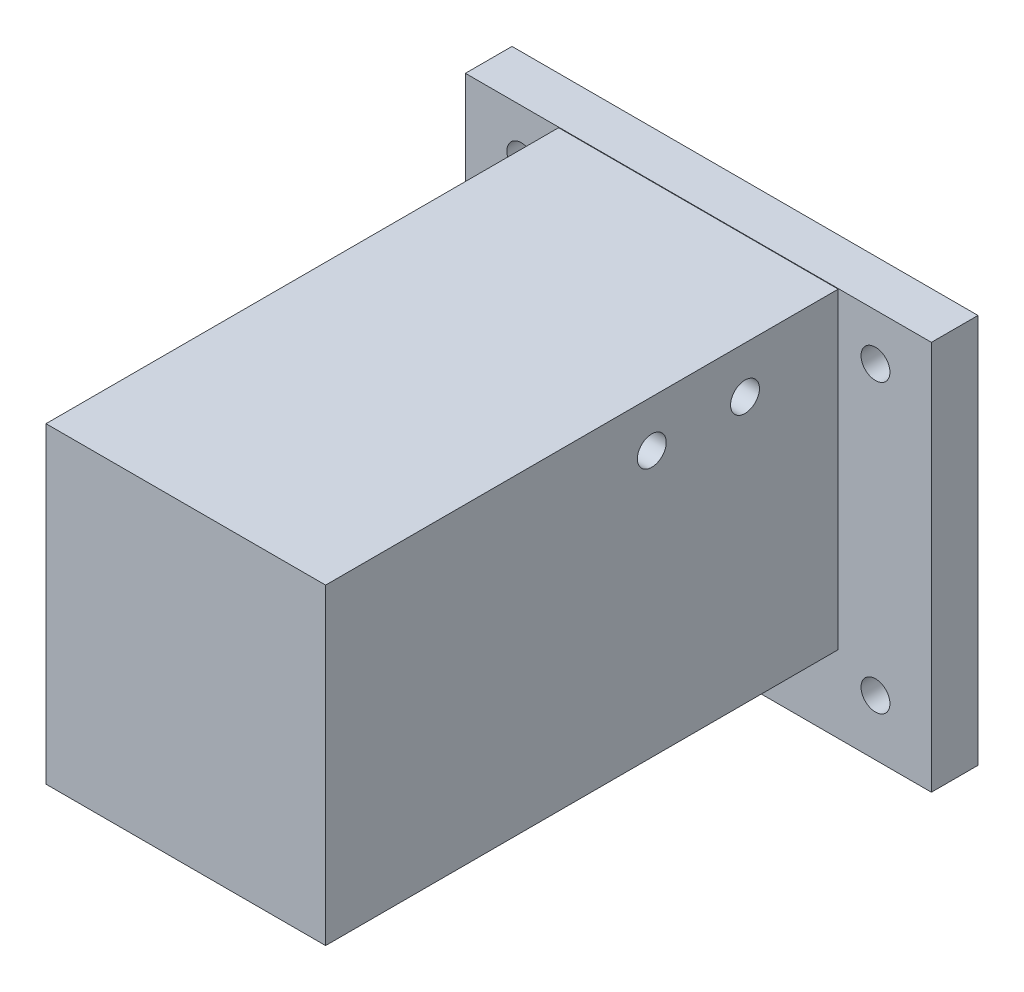
ISO-10303-21;
HEADER;
FILE_DESCRIPTION(('STEP AP214'),'2;1');
FILE_NAME('part.step','',(''),(''),'','','');
FILE_SCHEMA(('AUTOMOTIVE_DESIGN { 1 0 10303 214 1 1 1 1 }'));
ENDSEC;
DATA;
#1=APPLICATION_CONTEXT('core data for automotive mechanical design processes');
#2=APPLICATION_PROTOCOL_DEFINITION('international standard','automotive_design',2000,#1);
#3=PRODUCT_CONTEXT('',#1,'mechanical');
#4=PRODUCT('Part','Part','',(#3));
#5=PRODUCT_RELATED_PRODUCT_CATEGORY('part','',(#4));
#6=PRODUCT_DEFINITION_FORMATION('','',#4);
#7=PRODUCT_DEFINITION_CONTEXT('part definition',#1,'design');
#8=PRODUCT_DEFINITION('design','',#6,#7);
#9=PRODUCT_DEFINITION_SHAPE('','',#8);
#10=(LENGTH_UNIT() NAMED_UNIT(*) SI_UNIT(.MILLI.,.METRE.));
#11=(NAMED_UNIT(*) PLANE_ANGLE_UNIT() SI_UNIT($,.RADIAN.));
#12=(NAMED_UNIT(*) SI_UNIT($,.STERADIAN.) SOLID_ANGLE_UNIT());
#13=UNCERTAINTY_MEASURE_WITH_UNIT(LENGTH_MEASURE(1.E-05),#10,'distance_accuracy_value','');
#14=(GEOMETRIC_REPRESENTATION_CONTEXT(3) GLOBAL_UNCERTAINTY_ASSIGNED_CONTEXT((#13)) GLOBAL_UNIT_ASSIGNED_CONTEXT((#10,
#11,#12)) REPRESENTATION_CONTEXT('',''));
#15=CARTESIAN_POINT('',(0.,0.,0.));
#16=DIRECTION('',(0.,0.,1.));
#17=DIRECTION('',(1.,0.,0.));
#18=AXIS2_PLACEMENT_3D('',#15,#16,#17);
#19=CARTESIAN_POINT('',(0.,0.,5.));
#20=DIRECTION('',(0.,0.,1.));
#21=DIRECTION('',(1.,0.,0.));
#22=AXIS2_PLACEMENT_3D('',#19,#20,#21);
#23=PLANE('',#22);
#24=CARTESIAN_POINT('',(19.,-19.,5.));
#25=DIRECTION('',(0.,0.,1.));
#26=DIRECTION('',(1.,0.,0.));
#27=AXIS2_PLACEMENT_3D('',#24,#25,#26);
#28=CIRCLE('',#27,1.55);
#29=CARTESIAN_POINT('',(20.55,-19.,5.));
#30=VERTEX_POINT('',#29);
#31=EDGE_CURVE('E197',#30,#30,#28,.T.);
#32=ORIENTED_EDGE('',*,*,#31,.F.);
#33=EDGE_LOOP('',(#32));
#34=FACE_BOUND('',#33,.T.);
#35=DIRECTION('',(0.,1.,0.));
#36=VECTOR('',#35,1.);
#37=CARTESIAN_POINT('',(15.,16.75,5.));
#38=LINE('',#37,#36);
#39=CARTESIAN_POINT('',(15.,-16.75,5.));
#40=VERTEX_POINT('',#39);
#41=CARTESIAN_POINT('',(15.,16.75,5.));
#42=VERTEX_POINT('',#41);
#43=EDGE_CURVE('E272',#40,#42,#38,.T.);
#44=ORIENTED_EDGE('',*,*,#43,.F.);
#45=DIRECTION('',(1.,0.,0.));
#46=VECTOR('',#45,1.);
#47=CARTESIAN_POINT('',(-15.,-16.75,5.));
#48=LINE('',#47,#46);
#49=CARTESIAN_POINT('',(-15.,-16.75,5.));
#50=VERTEX_POINT('',#49);
#51=EDGE_CURVE('E292',#50,#40,#48,.T.);
#52=ORIENTED_EDGE('',*,*,#51,.F.);
#53=DIRECTION('',(0.,-1.,0.));
#54=VECTOR('',#53,1.);
#55=CARTESIAN_POINT('',(-15.,16.75,5.));
#56=LINE('',#55,#54);
#57=CARTESIAN_POINT('',(-15.,16.75,5.));
#58=VERTEX_POINT('',#57);
#59=EDGE_CURVE('E288',#58,#50,#56,.T.);
#60=ORIENTED_EDGE('',*,*,#59,.F.);
#61=DIRECTION('',(-1.,0.,0.));
#62=VECTOR('',#61,1.);
#63=CARTESIAN_POINT('',(-15.,16.75,5.));
#64=LINE('',#63,#62);
#65=EDGE_CURVE('E284',#42,#58,#64,.T.);
#66=ORIENTED_EDGE('',*,*,#65,.F.);
#67=EDGE_LOOP('',(#44,#52,#60,#66));
#68=FACE_BOUND('',#67,.T.);
#69=CARTESIAN_POINT('',(-19.,-19.,5.));
#70=DIRECTION('',(0.,0.,1.));
#71=DIRECTION('',(1.,0.,0.));
#72=AXIS2_PLACEMENT_3D('',#69,#70,#71);
#73=CIRCLE('',#72,1.55);
#74=CARTESIAN_POINT('',(-17.45,-19.,5.));
#75=VERTEX_POINT('',#74);
#76=EDGE_CURVE('E207',#75,#75,#73,.F.);
#77=ORIENTED_EDGE('',*,*,#76,.T.);
#78=EDGE_LOOP('',(#77));
#79=FACE_BOUND('',#78,.T.);
#80=DIRECTION('',(1.,0.,0.));
#81=VECTOR('',#80,1.);
#82=CARTESIAN_POINT('',(-25.,16.8068521324191,5.));
#83=LINE('',#82,#81);
#84=CARTESIAN_POINT('',(-25.,16.8068521324191,5.));
#85=VERTEX_POINT('',#84);
#86=CARTESIAN_POINT('',(25.,16.8068521324191,5.));
#87=VERTEX_POINT('',#86);
#88=EDGE_CURVE('E129',#85,#87,#83,.T.);
#89=ORIENTED_EDGE('',*,*,#88,.F.);
#90=DIRECTION('',(0.,-1.,0.));
#91=VECTOR('',#90,1.);
#92=CARTESIAN_POINT('',(-25.,25.,5.));
#93=LINE('',#92,#91);
#94=CARTESIAN_POINT('',(-25.,-25.,5.));
#95=VERTEX_POINT('',#94);
#96=EDGE_CURVE('E137',#85,#95,#93,.T.);
#97=ORIENTED_EDGE('',*,*,#96,.T.);
#98=DIRECTION('',(1.,0.,0.));
#99=VECTOR('',#98,1.);
#100=CARTESIAN_POINT('',(-25.,-25.,5.));
#101=LINE('',#100,#99);
#102=CARTESIAN_POINT('',(25.,-25.,5.));
#103=VERTEX_POINT('',#102);
#104=EDGE_CURVE('E150',#95,#103,#101,.T.);
#105=ORIENTED_EDGE('',*,*,#104,.T.);
#106=DIRECTION('',(0.,1.,0.));
#107=VECTOR('',#106,1.);
#108=CARTESIAN_POINT('',(25.,25.,5.));
#109=LINE('',#108,#107);
#110=EDGE_CURVE('E140',#103,#87,#109,.T.);
#111=ORIENTED_EDGE('',*,*,#110,.T.);
#112=EDGE_LOOP('',(#89,#97,#105,#111));
#113=FACE_BOUND('',#112,.T.);
#114=CARTESIAN_POINT('',(19.,11.8068521324191,5.));
#115=DIRECTION('',(0.,0.,1.));
#116=DIRECTION('',(1.,0.,0.));
#117=AXIS2_PLACEMENT_3D('',#114,#115,#116);
#118=CIRCLE('',#117,1.55);
#119=CARTESIAN_POINT('',(20.55,11.8068521324191,5.));
#120=VERTEX_POINT('',#119);
#121=EDGE_CURVE('E214',#120,#120,#118,.T.);
#122=ORIENTED_EDGE('',*,*,#121,.F.);
#123=EDGE_LOOP('',(#122));
#124=FACE_BOUND('',#123,.T.);
#125=CARTESIAN_POINT('',(-19.,11.8068521324191,5.));
#126=DIRECTION('',(0.,0.,1.));
#127=DIRECTION('',(1.,0.,0.));
#128=AXIS2_PLACEMENT_3D('',#125,#126,#127);
#129=CIRCLE('',#128,1.55);
#130=CARTESIAN_POINT('',(-17.45,11.8068521324191,5.));
#131=VERTEX_POINT('',#130);
#132=EDGE_CURVE('E143',#131,#131,#129,.F.);
#133=ORIENTED_EDGE('',*,*,#132,.T.);
#134=EDGE_LOOP('',(#133));
#135=FACE_BOUND('',#134,.T.);
#136=ADVANCED_FACE('F39',(#34,#68,#79,#113,#124,#135),#23,.T.);
#137=CARTESIAN_POINT('',(0.,0.,0.));
#138=DIRECTION('',(0.,0.,1.));
#139=DIRECTION('',(1.,0.,0.));
#140=AXIS2_PLACEMENT_3D('',#137,#138,#139);
#141=PLANE('',#140);
#142=CARTESIAN_POINT('',(19.,11.8068521324191,0.));
#143=DIRECTION('',(0.,0.,1.));
#144=DIRECTION('',(1.,0.,0.));
#145=AXIS2_PLACEMENT_3D('',#142,#143,#144);
#146=CIRCLE('',#145,1.55);
#147=CARTESIAN_POINT('',(20.55,11.8068521324191,0.));
#148=VERTEX_POINT('',#147);
#149=EDGE_CURVE('E211',#148,#148,#146,.T.);
#150=ORIENTED_EDGE('',*,*,#149,.T.);
#151=EDGE_LOOP('',(#150));
#152=FACE_BOUND('',#151,.T.);
#153=DIRECTION('',(0.,-1.,0.));
#154=VECTOR('',#153,1.);
#155=CARTESIAN_POINT('',(-25.,25.,0.));
#156=LINE('',#155,#154);
#157=CARTESIAN_POINT('',(-25.,16.8068521324191,0.));
#158=VERTEX_POINT('',#157);
#159=CARTESIAN_POINT('',(-25.,-25.,0.));
#160=VERTEX_POINT('',#159);
#161=EDGE_CURVE('E164',#158,#160,#156,.T.);
#162=ORIENTED_EDGE('',*,*,#161,.F.);
#163=DIRECTION('',(1.,0.,0.));
#164=VECTOR('',#163,1.);
#165=CARTESIAN_POINT('',(0.,16.8068521324191,0.));
#166=LINE('',#165,#164);
#167=CARTESIAN_POINT('',(25.,16.8068521324191,0.));
#168=VERTEX_POINT('',#167);
#169=EDGE_CURVE('E57',#158,#168,#166,.T.);
#170=ORIENTED_EDGE('',*,*,#169,.T.);
#171=DIRECTION('',(0.,1.,0.));
#172=VECTOR('',#171,1.);
#173=CARTESIAN_POINT('',(25.,25.,0.));
#174=LINE('',#173,#172);
#175=CARTESIAN_POINT('',(25.,-25.,0.));
#176=VERTEX_POINT('',#175);
#177=EDGE_CURVE('E160',#176,#168,#174,.T.);
#178=ORIENTED_EDGE('',*,*,#177,.F.);
#179=DIRECTION('',(1.,0.,0.));
#180=VECTOR('',#179,1.);
#181=CARTESIAN_POINT('',(-25.,-25.,0.));
#182=LINE('',#181,#180);
#183=EDGE_CURVE('E156',#160,#176,#182,.T.);
#184=ORIENTED_EDGE('',*,*,#183,.F.);
#185=EDGE_LOOP('',(#162,#170,#178,#184));
#186=FACE_BOUND('',#185,.T.);
#187=CARTESIAN_POINT('',(-19.,-19.,0.));
#188=DIRECTION('',(0.,0.,1.));
#189=DIRECTION('',(1.,0.,0.));
#190=AXIS2_PLACEMENT_3D('',#187,#188,#189);
#191=CIRCLE('',#190,1.55);
#192=CARTESIAN_POINT('',(-17.45,-19.,0.));
#193=VERTEX_POINT('',#192);
#194=EDGE_CURVE('E203',#193,#193,#191,.F.);
#195=ORIENTED_EDGE('',*,*,#194,.F.);
#196=EDGE_LOOP('',(#195));
#197=FACE_BOUND('',#196,.T.);
#198=CARTESIAN_POINT('',(19.,-19.,0.));
#199=DIRECTION('',(0.,0.,1.));
#200=DIRECTION('',(1.,0.,0.));
#201=AXIS2_PLACEMENT_3D('',#198,#199,#200);
#202=CIRCLE('',#201,1.55);
#203=CARTESIAN_POINT('',(20.55,-19.,0.));
#204=VERTEX_POINT('',#203);
#205=EDGE_CURVE('E208',#204,#204,#202,.T.);
#206=ORIENTED_EDGE('',*,*,#205,.T.);
#207=EDGE_LOOP('',(#206));
#208=FACE_BOUND('',#207,.T.);
#209=CARTESIAN_POINT('',(-19.,11.8068521324191,0.));
#210=DIRECTION('',(0.,0.,1.));
#211=DIRECTION('',(1.,0.,0.));
#212=AXIS2_PLACEMENT_3D('',#209,#210,#211);
#213=CIRCLE('',#212,1.55);
#214=CARTESIAN_POINT('',(-17.45,11.8068521324191,0.));
#215=VERTEX_POINT('',#214);
#216=EDGE_CURVE('E43',#215,#215,#213,.F.);
#217=ORIENTED_EDGE('',*,*,#216,.F.);
#218=EDGE_LOOP('',(#217));
#219=FACE_BOUND('',#218,.T.);
#220=ADVANCED_FACE('F342',(#152,#186,#197,#208,#219),#141,.F.);
#221=CARTESIAN_POINT('',(15.,16.75,75.));
#222=DIRECTION('',(-1.,0.,0.));
#223=DIRECTION('',(0.,0.,1.));
#224=AXIS2_PLACEMENT_3D('',#221,#222,#223);
#225=PLANE('',#224);
#226=DIRECTION('',(0.,1.,0.));
#227=VECTOR('',#226,1.);
#228=CARTESIAN_POINT('',(15.,-25.,60.));
#229=LINE('',#228,#227);
#230=CARTESIAN_POINT('',(15.,-16.75,60.));
#231=VERTEX_POINT('',#230);
#232=CARTESIAN_POINT('',(15.,16.75,60.));
#233=VERTEX_POINT('',#232);
#234=EDGE_CURVE('E244',#231,#233,#229,.T.);
#235=ORIENTED_EDGE('',*,*,#234,.F.);
#236=DIRECTION('',(0.,0.,-1.));
#237=VECTOR('',#236,1.);
#238=CARTESIAN_POINT('',(15.,-16.75,75.));
#239=LINE('',#238,#237);
#240=EDGE_CURVE('E296',#231,#40,#239,.T.);
#241=ORIENTED_EDGE('',*,*,#240,.T.);
#242=ORIENTED_EDGE('',*,*,#43,.T.);
#243=DIRECTION('',(0.,0.,-1.));
#244=VECTOR('',#243,1.);
#245=CARTESIAN_POINT('',(15.,16.75,75.));
#246=LINE('',#245,#244);
#247=EDGE_CURVE('E165',#233,#42,#246,.T.);
#248=ORIENTED_EDGE('',*,*,#247,.F.);
#249=EDGE_LOOP('',(#235,#241,#242,#248));
#250=FACE_BOUND('',#249,.T.);
#251=CARTESIAN_POINT('',(15.,11.75,15.));
#252=DIRECTION('',(-1.,0.,0.));
#253=DIRECTION('',(0.,0.,1.));
#254=AXIS2_PLACEMENT_3D('',#251,#252,#253);
#255=CIRCLE('',#254,1.55);
#256=CARTESIAN_POINT('',(15.,11.75,16.55));
#257=VERTEX_POINT('',#256);
#258=EDGE_CURVE('E196',#257,#257,#255,.F.);
#259=ORIENTED_EDGE('',*,*,#258,.F.);
#260=EDGE_LOOP('',(#259));
#261=FACE_BOUND('',#260,.T.);
#262=CARTESIAN_POINT('',(15.,11.75,25.));
#263=DIRECTION('',(-1.,0.,0.));
#264=DIRECTION('',(0.,0.,1.));
#265=AXIS2_PLACEMENT_3D('',#262,#263,#264);
#266=CIRCLE('',#265,1.55);
#267=CARTESIAN_POINT('',(15.,11.75,26.55));
#268=VERTEX_POINT('',#267);
#269=EDGE_CURVE('E202',#268,#268,#266,.T.);
#270=ORIENTED_EDGE('',*,*,#269,.T.);
#271=EDGE_LOOP('',(#270));
#272=FACE_BOUND('',#271,.T.);
#273=ADVANCED_FACE('F318',(#250,#261,#272),#225,.F.);
#274=CARTESIAN_POINT('',(-15.,16.75,75.));
#275=DIRECTION('',(1.,0.,0.));
#276=DIRECTION('',(0.,1.,0.));
#277=AXIS2_PLACEMENT_3D('',#274,#275,#276);
#278=PLANE('',#277);
#279=DIRECTION('',(0.,1.,0.));
#280=VECTOR('',#279,1.);
#281=CARTESIAN_POINT('',(-15.,-25.,60.));
#282=LINE('',#281,#280);
#283=CARTESIAN_POINT('',(-15.,-16.75,60.));
#284=VERTEX_POINT('',#283);
#285=CARTESIAN_POINT('',(-15.,16.75,60.));
#286=VERTEX_POINT('',#285);
#287=EDGE_CURVE('E64',#284,#286,#282,.T.);
#288=ORIENTED_EDGE('',*,*,#287,.T.);
#289=DIRECTION('',(0.,0.,-1.));
#290=VECTOR('',#289,1.);
#291=CARTESIAN_POINT('',(-15.,16.75,75.));
#292=LINE('',#291,#290);
#293=EDGE_CURVE('E302',#286,#58,#292,.T.);
#294=ORIENTED_EDGE('',*,*,#293,.T.);
#295=ORIENTED_EDGE('',*,*,#59,.T.);
#296=DIRECTION('',(0.,0.,-1.));
#297=VECTOR('',#296,1.);
#298=CARTESIAN_POINT('',(-15.,-16.75,75.));
#299=LINE('',#298,#297);
#300=EDGE_CURVE('E299',#284,#50,#299,.T.);
#301=ORIENTED_EDGE('',*,*,#300,.F.);
#302=EDGE_LOOP('',(#288,#294,#295,#301));
#303=FACE_BOUND('',#302,.T.);
#304=CARTESIAN_POINT('',(-15.,11.75,15.));
#305=DIRECTION('',(1.,0.,0.));
#306=DIRECTION('',(0.,1.,0.));
#307=AXIS2_PLACEMENT_3D('',#304,#305,#306);
#308=CIRCLE('',#307,1.55);
#309=CARTESIAN_POINT('',(-15.,13.3,15.));
#310=VERTEX_POINT('',#309);
#311=EDGE_CURVE('E192',#310,#310,#308,.F.);
#312=ORIENTED_EDGE('',*,*,#311,.F.);
#313=EDGE_LOOP('',(#312));
#314=FACE_BOUND('',#313,.T.);
#315=CARTESIAN_POINT('',(-15.,11.75,25.));
#316=DIRECTION('',(1.,0.,0.));
#317=DIRECTION('',(0.,1.,0.));
#318=AXIS2_PLACEMENT_3D('',#315,#316,#317);
#319=CIRCLE('',#318,1.55);
#320=CARTESIAN_POINT('',(-15.,13.3,25.));
#321=VERTEX_POINT('',#320);
#322=EDGE_CURVE('E198',#321,#321,#319,.T.);
#323=ORIENTED_EDGE('',*,*,#322,.T.);
#324=EDGE_LOOP('',(#323));
#325=FACE_BOUND('',#324,.T.);
#326=ADVANCED_FACE('F325',(#303,#314,#325),#278,.F.);
#327=CARTESIAN_POINT('',(-15.,16.75,75.));
#328=DIRECTION('',(0.,-1.,0.));
#329=DIRECTION('',(0.,0.,-1.));
#330=AXIS2_PLACEMENT_3D('',#327,#328,#329);
#331=PLANE('',#330);
#332=DIRECTION('',(-1.,0.,0.));
#333=VECTOR('',#332,1.);
#334=CARTESIAN_POINT('',(-15.,16.75,60.));
#335=LINE('',#334,#333);
#336=EDGE_CURVE('E247',#233,#286,#335,.T.);
#337=ORIENTED_EDGE('',*,*,#336,.F.);
#338=ORIENTED_EDGE('',*,*,#247,.T.);
#339=ORIENTED_EDGE('',*,*,#65,.T.);
#340=ORIENTED_EDGE('',*,*,#293,.F.);
#341=EDGE_LOOP('',(#337,#338,#339,#340));
#342=FACE_BOUND('',#341,.T.);
#343=ADVANCED_FACE('F309',(#342),#331,.F.);
#344=CARTESIAN_POINT('',(-15.,-16.75,75.));
#345=DIRECTION('',(0.,1.,0.));
#346=DIRECTION('',(0.,0.,1.));
#347=AXIS2_PLACEMENT_3D('',#344,#345,#346);
#348=PLANE('',#347);
#349=DIRECTION('',(0.,0.,1.));
#350=VECTOR('',#349,1.);
#351=CARTESIAN_POINT('',(-9.99999999999999,-16.75,75.));
#352=LINE('',#351,#350);
#353=CARTESIAN_POINT('',(-10.,-16.75,15.));
#354=VERTEX_POINT('',#353);
#355=CARTESIAN_POINT('',(-10.,-16.75,56.));
#356=VERTEX_POINT('',#355);
#357=EDGE_CURVE('E182',#354,#356,#352,.T.);
#358=ORIENTED_EDGE('',*,*,#357,.T.);
#359=DIRECTION('',(1.,0.,0.));
#360=VECTOR('',#359,1.);
#361=CARTESIAN_POINT('',(-15.,-16.75,56.));
#362=LINE('',#361,#360);
#363=CARTESIAN_POINT('',(10.,-16.75,56.));
#364=VERTEX_POINT('',#363);
#365=EDGE_CURVE('E186',#356,#364,#362,.T.);
#366=ORIENTED_EDGE('',*,*,#365,.T.);
#367=DIRECTION('',(0.,0.,1.));
#368=VECTOR('',#367,1.);
#369=CARTESIAN_POINT('',(10.,-16.75,75.));
#370=LINE('',#369,#368);
#371=CARTESIAN_POINT('',(10.,-16.75,15.));
#372=VERTEX_POINT('',#371);
#373=EDGE_CURVE('E175',#372,#364,#370,.T.);
#374=ORIENTED_EDGE('',*,*,#373,.F.);
#375=DIRECTION('',(1.,0.,0.));
#376=VECTOR('',#375,1.);
#377=CARTESIAN_POINT('',(-15.,-16.75,15.));
#378=LINE('',#377,#376);
#379=EDGE_CURVE('E178',#354,#372,#378,.T.);
#380=ORIENTED_EDGE('',*,*,#379,.F.);
#381=EDGE_LOOP('',(#358,#366,#374,#380));
#382=FACE_BOUND('',#381,.T.);
#383=DIRECTION('',(1.,0.,0.));
#384=VECTOR('',#383,1.);
#385=CARTESIAN_POINT('',(-15.,-16.75,60.));
#386=LINE('',#385,#384);
#387=EDGE_CURVE('E49',#284,#231,#386,.T.);
#388=ORIENTED_EDGE('',*,*,#387,.F.);
#389=ORIENTED_EDGE('',*,*,#300,.T.);
#390=ORIENTED_EDGE('',*,*,#51,.T.);
#391=ORIENTED_EDGE('',*,*,#240,.F.);
#392=EDGE_LOOP('',(#388,#389,#390,#391));
#393=FACE_BOUND('',#392,.T.);
#394=ADVANCED_FACE('F322',(#382,#393),#348,.F.);
#395=CARTESIAN_POINT('',(25.,25.,5.));
#396=DIRECTION('',(-1.,0.,0.));
#397=DIRECTION('',(0.,-1.,0.));
#398=AXIS2_PLACEMENT_3D('',#395,#396,#397);
#399=PLANE('',#398);
#400=ORIENTED_EDGE('',*,*,#177,.T.);
#401=DIRECTION('',(0.,0.,1.));
#402=VECTOR('',#401,1.);
#403=CARTESIAN_POINT('',(25.,16.8068521324191,-20.));
#404=LINE('',#403,#402);
#405=EDGE_CURVE('E142',#168,#87,#404,.T.);
#406=ORIENTED_EDGE('',*,*,#405,.T.);
#407=ORIENTED_EDGE('',*,*,#110,.F.);
#408=DIRECTION('',(0.,0.,-1.));
#409=VECTOR('',#408,1.);
#410=CARTESIAN_POINT('',(25.,-25.,5.));
#411=LINE('',#410,#409);
#412=EDGE_CURVE('E154',#103,#176,#411,.T.);
#413=ORIENTED_EDGE('',*,*,#412,.T.);
#414=EDGE_LOOP('',(#400,#406,#407,#413));
#415=FACE_BOUND('',#414,.T.);
#416=ADVANCED_FACE('F41',(#415),#399,.F.);
#417=CARTESIAN_POINT('',(-25.,25.,5.));
#418=DIRECTION('',(1.,0.,0.));
#419=DIRECTION('',(0.,1.,0.));
#420=AXIS2_PLACEMENT_3D('',#417,#418,#419);
#421=PLANE('',#420);
#422=ORIENTED_EDGE('',*,*,#96,.F.);
#423=DIRECTION('',(0.,0.,-1.));
#424=VECTOR('',#423,1.);
#425=CARTESIAN_POINT('',(-25.,16.8068521324191,5.));
#426=LINE('',#425,#424);
#427=EDGE_CURVE('E11',#85,#158,#426,.T.);
#428=ORIENTED_EDGE('',*,*,#427,.T.);
#429=ORIENTED_EDGE('',*,*,#161,.T.);
#430=DIRECTION('',(0.,0.,-1.));
#431=VECTOR('',#430,1.);
#432=CARTESIAN_POINT('',(-25.,-25.,5.));
#433=LINE('',#432,#431);
#434=EDGE_CURVE('E147',#95,#160,#433,.T.);
#435=ORIENTED_EDGE('',*,*,#434,.F.);
#436=EDGE_LOOP('',(#422,#428,#429,#435));
#437=FACE_BOUND('',#436,.T.);
#438=ADVANCED_FACE('F145',(#437),#421,.F.);
#439=CARTESIAN_POINT('',(-25.,-25.,5.));
#440=DIRECTION('',(0.,1.,0.));
#441=DIRECTION('',(0.,0.,1.));
#442=AXIS2_PLACEMENT_3D('',#439,#440,#441);
#443=PLANE('',#442);
#444=ORIENTED_EDGE('',*,*,#183,.T.);
#445=ORIENTED_EDGE('',*,*,#412,.F.);
#446=ORIENTED_EDGE('',*,*,#104,.F.);
#447=ORIENTED_EDGE('',*,*,#434,.T.);
#448=EDGE_LOOP('',(#444,#445,#446,#447));
#449=FACE_BOUND('',#448,.T.);
#450=ADVANCED_FACE('F356',(#449),#443,.F.);
#451=CARTESIAN_POINT('',(-10.,-17.,56.));
#452=DIRECTION('',(0.,0.,1.));
#453=DIRECTION('',(1.,0.,0.));
#454=AXIS2_PLACEMENT_3D('',#451,#452,#453);
#455=PLANE('',#454);
#456=DIRECTION('',(0.,1.,0.));
#457=VECTOR('',#456,1.);
#458=CARTESIAN_POINT('',(-10.,-17.,56.));
#459=LINE('',#458,#457);
#460=CARTESIAN_POINT('',(-10.,2.,56.));
#461=VERTEX_POINT('',#460);
#462=EDGE_CURVE('E269',#356,#461,#459,.T.);
#463=ORIENTED_EDGE('',*,*,#462,.T.);
#464=DIRECTION('',(1.,0.,0.));
#465=VECTOR('',#464,1.);
#466=CARTESIAN_POINT('',(-10.,2.,56.));
#467=LINE('',#466,#465);
#468=CARTESIAN_POINT('',(10.,2.,56.));
#469=VERTEX_POINT('',#468);
#470=EDGE_CURVE('E252',#461,#469,#467,.T.);
#471=ORIENTED_EDGE('',*,*,#470,.T.);
#472=DIRECTION('',(0.,1.,0.));
#473=VECTOR('',#472,1.);
#474=CARTESIAN_POINT('',(10.,-17.,56.));
#475=LINE('',#474,#473);
#476=EDGE_CURVE('E268',#364,#469,#475,.T.);
#477=ORIENTED_EDGE('',*,*,#476,.F.);
#478=ORIENTED_EDGE('',*,*,#365,.F.);
#479=EDGE_LOOP('',(#463,#471,#477,#478));
#480=FACE_BOUND('',#479,.T.);
#481=ADVANCED_FACE('F358',(#480),#455,.F.);
#482=CARTESIAN_POINT('',(-10.,-17.,15.));
#483=DIRECTION('',(-1.,0.,0.));
#484=DIRECTION('',(0.,0.,1.));
#485=AXIS2_PLACEMENT_3D('',#482,#483,#484);
#486=PLANE('',#485);
#487=DIRECTION('',(0.,1.,0.));
#488=VECTOR('',#487,1.);
#489=CARTESIAN_POINT('',(-10.,-17.,15.));
#490=LINE('',#489,#488);
#491=CARTESIAN_POINT('',(-10.,2.,15.));
#492=VERTEX_POINT('',#491);
#493=EDGE_CURVE('E273',#354,#492,#490,.T.);
#494=ORIENTED_EDGE('',*,*,#493,.T.);
#495=DIRECTION('',(0.,0.,1.));
#496=VECTOR('',#495,1.);
#497=CARTESIAN_POINT('',(-10.,2.,15.));
#498=LINE('',#497,#496);
#499=EDGE_CURVE('E264',#492,#461,#498,.T.);
#500=ORIENTED_EDGE('',*,*,#499,.T.);
#501=ORIENTED_EDGE('',*,*,#462,.F.);
#502=ORIENTED_EDGE('',*,*,#357,.F.);
#503=EDGE_LOOP('',(#494,#500,#501,#502));
#504=FACE_BOUND('',#503,.T.);
#505=ADVANCED_FACE('F412',(#504),#486,.F.);
#506=CARTESIAN_POINT('',(-10.,-17.,15.));
#507=DIRECTION('',(0.,0.,1.));
#508=DIRECTION('',(1.,0.,0.));
#509=AXIS2_PLACEMENT_3D('',#506,#507,#508);
#510=PLANE('',#509);
#511=ORIENTED_EDGE('',*,*,#379,.T.);
#512=DIRECTION('',(0.,1.,0.));
#513=VECTOR('',#512,1.);
#514=CARTESIAN_POINT('',(10.,-17.,15.));
#515=LINE('',#514,#513);
#516=CARTESIAN_POINT('',(10.,2.,15.));
#517=VERTEX_POINT('',#516);
#518=EDGE_CURVE('E276',#372,#517,#515,.T.);
#519=ORIENTED_EDGE('',*,*,#518,.T.);
#520=DIRECTION('',(1.,0.,0.));
#521=VECTOR('',#520,1.);
#522=CARTESIAN_POINT('',(-10.,2.,15.));
#523=LINE('',#522,#521);
#524=EDGE_CURVE('E260',#492,#517,#523,.T.);
#525=ORIENTED_EDGE('',*,*,#524,.F.);
#526=ORIENTED_EDGE('',*,*,#493,.F.);
#527=EDGE_LOOP('',(#511,#519,#525,#526));
#528=FACE_BOUND('',#527,.T.);
#529=ADVANCED_FACE('F415',(#528),#510,.T.);
#530=CARTESIAN_POINT('',(10.,-17.,15.));
#531=DIRECTION('',(-1.,0.,0.));
#532=DIRECTION('',(0.,0.,1.));
#533=AXIS2_PLACEMENT_3D('',#530,#531,#532);
#534=PLANE('',#533);
#535=ORIENTED_EDGE('',*,*,#373,.T.);
#536=ORIENTED_EDGE('',*,*,#476,.T.);
#537=DIRECTION('',(0.,0.,1.));
#538=VECTOR('',#537,1.);
#539=CARTESIAN_POINT('',(10.,2.,15.));
#540=LINE('',#539,#538);
#541=EDGE_CURVE('E256',#517,#469,#540,.T.);
#542=ORIENTED_EDGE('',*,*,#541,.F.);
#543=ORIENTED_EDGE('',*,*,#518,.F.);
#544=EDGE_LOOP('',(#535,#536,#542,#543));
#545=FACE_BOUND('',#544,.T.);
#546=ADVANCED_FACE('F410',(#545),#534,.T.);
#547=CARTESIAN_POINT('',(0.,2.,0.));
#548=DIRECTION('',(0.,-1.,0.));
#549=DIRECTION('',(0.,0.,-1.));
#550=AXIS2_PLACEMENT_3D('',#547,#548,#549);
#551=PLANE('',#550);
#552=ORIENTED_EDGE('',*,*,#470,.F.);
#553=ORIENTED_EDGE('',*,*,#499,.F.);
#554=ORIENTED_EDGE('',*,*,#524,.T.);
#555=ORIENTED_EDGE('',*,*,#541,.T.);
#556=EDGE_LOOP('',(#552,#553,#554,#555));
#557=FACE_BOUND('',#556,.T.);
#558=ADVANCED_FACE('F407',(#557),#551,.T.);
#559=CARTESIAN_POINT('',(0.,-25.,60.));
#560=DIRECTION('',(0.,0.,1.));
#561=DIRECTION('',(1.,0.,0.));
#562=AXIS2_PLACEMENT_3D('',#559,#560,#561);
#563=PLANE('',#562);
#564=ORIENTED_EDGE('',*,*,#336,.T.);
#565=ORIENTED_EDGE('',*,*,#287,.F.);
#566=ORIENTED_EDGE('',*,*,#387,.T.);
#567=ORIENTED_EDGE('',*,*,#234,.T.);
#568=EDGE_LOOP('',(#564,#565,#566,#567));
#569=FACE_BOUND('',#568,.T.);
#570=ADVANCED_FACE('F403',(#569),#563,.T.);
#571=CARTESIAN_POINT('',(-25.,11.75,15.));
#572=DIRECTION('',(1.,0.,0.));
#573=DIRECTION('',(0.,0.,-1.));
#574=AXIS2_PLACEMENT_3D('',#571,#572,#573);
#575=CYLINDRICAL_SURFACE('',#574,1.55);
#576=ORIENTED_EDGE('',*,*,#311,.T.);
#577=EDGE_LOOP('',(#576));
#578=FACE_BOUND('',#577,.T.);
#579=ORIENTED_EDGE('',*,*,#258,.T.);
#580=EDGE_LOOP('',(#579));
#581=FACE_BOUND('',#580,.T.);
#582=ADVANCED_FACE('F337',(#578,#581),#575,.F.);
#583=CARTESIAN_POINT('',(-25.,11.75,25.));
#584=DIRECTION('',(1.,0.,0.));
#585=DIRECTION('',(0.,0.,-1.));
#586=AXIS2_PLACEMENT_3D('',#583,#584,#585);
#587=CYLINDRICAL_SURFACE('',#586,1.55);
#588=ORIENTED_EDGE('',*,*,#322,.F.);
#589=EDGE_LOOP('',(#588));
#590=FACE_BOUND('',#589,.T.);
#591=ORIENTED_EDGE('',*,*,#269,.F.);
#592=EDGE_LOOP('',(#591));
#593=FACE_BOUND('',#592,.T.);
#594=ADVANCED_FACE('F333',(#590,#593),#587,.F.);
#595=CARTESIAN_POINT('',(-19.,-19.,-1.2E-05));
#596=DIRECTION('',(0.,0.,1.));
#597=DIRECTION('',(1.,0.,0.));
#598=AXIS2_PLACEMENT_3D('',#595,#596,#597);
#599=CYLINDRICAL_SURFACE('',#598,1.55);
#600=ORIENTED_EDGE('',*,*,#76,.F.);
#601=EDGE_LOOP('',(#600));
#602=FACE_BOUND('',#601,.T.);
#603=ORIENTED_EDGE('',*,*,#194,.T.);
#604=EDGE_LOOP('',(#603));
#605=FACE_BOUND('',#604,.T.);
#606=ADVANCED_FACE('F336',(#602,#605),#599,.F.);
#607=CARTESIAN_POINT('',(19.,-19.,-1.2E-05));
#608=DIRECTION('',(0.,0.,1.));
#609=DIRECTION('',(1.,0.,0.));
#610=AXIS2_PLACEMENT_3D('',#607,#608,#609);
#611=CYLINDRICAL_SURFACE('',#610,1.55);
#612=ORIENTED_EDGE('',*,*,#31,.T.);
#613=EDGE_LOOP('',(#612));
#614=FACE_BOUND('',#613,.T.);
#615=ORIENTED_EDGE('',*,*,#205,.F.);
#616=EDGE_LOOP('',(#615));
#617=FACE_BOUND('',#616,.T.);
#618=ADVANCED_FACE('F394',(#614,#617),#611,.F.);
#619=CARTESIAN_POINT('',(-25.,16.8068521324191,-20.));
#620=DIRECTION('',(0.,-1.,0.));
#621=DIRECTION('',(0.,0.,-1.));
#622=AXIS2_PLACEMENT_3D('',#619,#620,#621);
#623=PLANE('',#622);
#624=ORIENTED_EDGE('',*,*,#427,.F.);
#625=ORIENTED_EDGE('',*,*,#88,.T.);
#626=ORIENTED_EDGE('',*,*,#405,.F.);
#627=ORIENTED_EDGE('',*,*,#169,.F.);
#628=EDGE_LOOP('',(#624,#625,#626,#627));
#629=FACE_BOUND('',#628,.T.);
#630=ADVANCED_FACE('F128',(#629),#623,.F.);
#631=CARTESIAN_POINT('',(19.,11.8068521324191,60.));
#632=DIRECTION('',(0.,0.,-1.));
#633=DIRECTION('',(-1.,0.,0.));
#634=AXIS2_PLACEMENT_3D('',#631,#632,#633);
#635=CYLINDRICAL_SURFACE('',#634,1.55);
#636=ORIENTED_EDGE('',*,*,#121,.T.);
#637=EDGE_LOOP('',(#636));
#638=FACE_BOUND('',#637,.T.);
#639=ORIENTED_EDGE('',*,*,#149,.F.);
#640=EDGE_LOOP('',(#639));
#641=FACE_BOUND('',#640,.T.);
#642=ADVANCED_FACE('F383',(#638,#641),#635,.F.);
#643=CARTESIAN_POINT('',(-19.,11.8068521324191,60.));
#644=DIRECTION('',(0.,0.,-1.));
#645=DIRECTION('',(-1.,0.,0.));
#646=AXIS2_PLACEMENT_3D('',#643,#644,#645);
#647=CYLINDRICAL_SURFACE('',#646,1.55);
#648=ORIENTED_EDGE('',*,*,#132,.F.);
#649=EDGE_LOOP('',(#648));
#650=FACE_BOUND('',#649,.T.);
#651=ORIENTED_EDGE('',*,*,#216,.T.);
#652=EDGE_LOOP('',(#651));
#653=FACE_BOUND('',#652,.T.);
#654=ADVANCED_FACE('F381',(#650,#653),#647,.F.);
#655=CLOSED_SHELL('',(#136,#220,#273,#326,#343,#394,#416,#438,#450,#481,#505,#529,#546,#558,
#570,#582,#594,#606,#618,#630,#642,#654));
#656=MANIFOLD_SOLID_BREP('B2',#655);
#657=ADVANCED_BREP_SHAPE_REPRESENTATION('',(#18,#656),#14);
#658=SHAPE_DEFINITION_REPRESENTATION(#9,#657);
ENDSEC;
END-ISO-10303-21;
